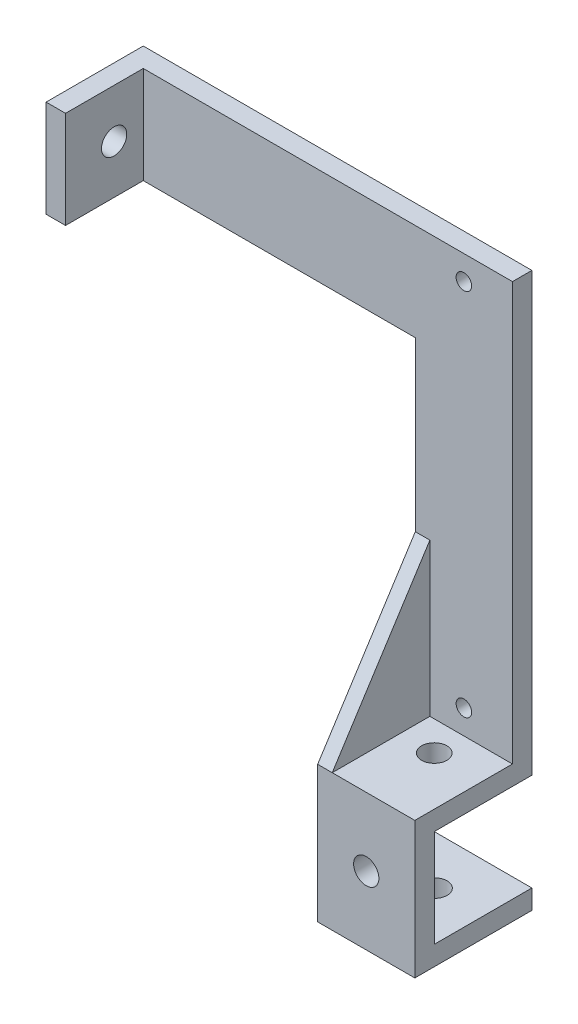
ISO-10303-21;
HEADER;
FILE_DESCRIPTION(('STEP AP214'),'2;1');
FILE_NAME('part.step','',(''),(''),'','','');
FILE_SCHEMA(('AUTOMOTIVE_DESIGN { 1 0 10303 214 1 1 1 1 }'));
ENDSEC;
DATA;
#1=APPLICATION_CONTEXT('core data for automotive mechanical design processes');
#2=APPLICATION_PROTOCOL_DEFINITION('international standard','automotive_design',2000,#1);
#3=PRODUCT_CONTEXT('',#1,'mechanical');
#4=PRODUCT('Part','Part','',(#3));
#5=PRODUCT_RELATED_PRODUCT_CATEGORY('part','',(#4));
#6=PRODUCT_DEFINITION_FORMATION('','',#4);
#7=PRODUCT_DEFINITION_CONTEXT('part definition',#1,'design');
#8=PRODUCT_DEFINITION('design','',#6,#7);
#9=PRODUCT_DEFINITION_SHAPE('','',#8);
#10=(LENGTH_UNIT() NAMED_UNIT(*) SI_UNIT(.MILLI.,.METRE.));
#11=(NAMED_UNIT(*) PLANE_ANGLE_UNIT() SI_UNIT($,.RADIAN.));
#12=(NAMED_UNIT(*) SI_UNIT($,.STERADIAN.) SOLID_ANGLE_UNIT());
#13=UNCERTAINTY_MEASURE_WITH_UNIT(LENGTH_MEASURE(1.E-05),#10,'distance_accuracy_value','');
#14=(GEOMETRIC_REPRESENTATION_CONTEXT(3) GLOBAL_UNCERTAINTY_ASSIGNED_CONTEXT((#13)) GLOBAL_UNIT_ASSIGNED_CONTEXT((#10,
#11,#12)) REPRESENTATION_CONTEXT('',''));
#15=CARTESIAN_POINT('',(0.,0.,0.));
#16=DIRECTION('',(0.,0.,1.));
#17=DIRECTION('',(1.,0.,0.));
#18=AXIS2_PLACEMENT_3D('',#15,#16,#17);
#19=CARTESIAN_POINT('',(0.,0.,4.));
#20=DIRECTION('',(0.,0.,-1.));
#21=DIRECTION('',(-1.,0.,0.));
#22=AXIS2_PLACEMENT_3D('',#19,#20,#21);
#23=PLANE('',#22);
#24=CARTESIAN_POINT('',(-19.2096770606013,-38.2608856625275,4.));
#25=DIRECTION('',(0.,0.,-1.));
#26=DIRECTION('',(-1.,0.,0.));
#27=AXIS2_PLACEMENT_3D('',#24,#25,#26);
#28=CIRCLE('',#27,1.6);
#29=CARTESIAN_POINT('',(-20.8096770606013,-38.2608856625275,4.));
#30=VERTEX_POINT('',#29);
#31=EDGE_CURVE('E241',#30,#30,#28,.T.);
#32=ORIENTED_EDGE('',*,*,#31,.T.);
#33=EDGE_LOOP('',(#32));
#34=FACE_BOUND('',#33,.T.);
#35=CARTESIAN_POINT('',(-19.2096770606013,37.7391143374725,4.));
#36=DIRECTION('',(0.,0.,-1.));
#37=DIRECTION('',(-1.,0.,0.));
#38=AXIS2_PLACEMENT_3D('',#35,#36,#37);
#39=CIRCLE('',#38,1.6);
#40=CARTESIAN_POINT('',(-20.8096770606013,37.7391143374725,4.));
#41=VERTEX_POINT('',#40);
#42=EDGE_CURVE('E248',#41,#41,#39,.T.);
#43=ORIENTED_EDGE('',*,*,#42,.T.);
#44=EDGE_LOOP('',(#43));
#45=FACE_BOUND('',#44,.T.);
#46=DIRECTION('',(0.,1.,0.));
#47=VECTOR('',#46,1.);
#48=CARTESIAN_POINT('',(-85.2096770606013,42.7391143374725,4.));
#49=LINE('',#48,#47);
#50=CARTESIAN_POINT('',(-85.2096770606013,22.7391143374725,4.));
#51=VERTEX_POINT('',#50);
#52=CARTESIAN_POINT('',(-85.2096770606013,42.7391143374725,4.));
#53=VERTEX_POINT('',#52);
#54=EDGE_CURVE('E182',#51,#53,#49,.T.);
#55=ORIENTED_EDGE('',*,*,#54,.F.);
#56=DIRECTION('',(1.,0.,0.));
#57=VECTOR('',#56,1.);
#58=CARTESIAN_POINT('',(-89.2096770606013,22.7391143374725,4.));
#59=LINE('',#58,#57);
#60=CARTESIAN_POINT('',(-29.2096770606013,22.7391143374725,4.));
#61=VERTEX_POINT('',#60);
#62=EDGE_CURVE('E166',#51,#61,#59,.T.);
#63=ORIENTED_EDGE('',*,*,#62,.T.);
#64=DIRECTION('',(0.,-1.,0.));
#65=VECTOR('',#64,1.);
#66=CARTESIAN_POINT('',(-29.2096770606013,42.7391143374725,4.));
#67=LINE('',#66,#65);
#68=CARTESIAN_POINT('',(-29.2096770606013,-11.8482809730409,4.));
#69=VERTEX_POINT('',#68);
#70=EDGE_CURVE('E340',#61,#69,#67,.T.);
#71=ORIENTED_EDGE('',*,*,#70,.T.);
#72=DIRECTION('',(-1.,0.,0.));
#73=VECTOR('',#72,1.);
#74=CARTESIAN_POINT('',(-26.2096770606013,-11.8482809730409,4.));
#75=LINE('',#74,#73);
#76=CARTESIAN_POINT('',(-26.2096770606013,-11.8482809730409,4.));
#77=VERTEX_POINT('',#76);
#78=EDGE_CURVE('E229',#77,#69,#75,.T.);
#79=ORIENTED_EDGE('',*,*,#78,.F.);
#80=DIRECTION('',(0.,-1.,0.));
#81=VECTOR('',#80,1.);
#82=CARTESIAN_POINT('',(-26.2096770606013,-43.2608856625275,4.));
#83=LINE('',#82,#81);
#84=CARTESIAN_POINT('',(-26.2096770606013,-43.2608856625275,4.));
#85=VERTEX_POINT('',#84);
#86=EDGE_CURVE('E213',#77,#85,#83,.T.);
#87=ORIENTED_EDGE('',*,*,#86,.T.);
#88=DIRECTION('',(-1.,0.,0.));
#89=VECTOR('',#88,1.);
#90=CARTESIAN_POINT('',(-29.2096770606013,-43.2608856625275,4.));
#91=LINE('',#90,#89);
#92=CARTESIAN_POINT('',(-9.20967706060125,-43.2608856625275,4.));
#93=VERTEX_POINT('',#92);
#94=EDGE_CURVE('E313',#93,#85,#91,.T.);
#95=ORIENTED_EDGE('',*,*,#94,.F.);
#96=DIRECTION('',(0.,1.,0.));
#97=VECTOR('',#96,1.);
#98=CARTESIAN_POINT('',(-9.20967706060126,42.7391143374725,4.));
#99=LINE('',#98,#97);
#100=CARTESIAN_POINT('',(-9.20967706060126,42.7391143374725,4.));
#101=VERTEX_POINT('',#100);
#102=EDGE_CURVE('E332',#93,#101,#99,.T.);
#103=ORIENTED_EDGE('',*,*,#102,.T.);
#104=DIRECTION('',(-1.,0.,0.));
#105=VECTOR('',#104,1.);
#106=CARTESIAN_POINT('',(-9.20967706060126,42.7391143374725,4.));
#107=LINE('',#106,#105);
#108=EDGE_CURVE('E335',#101,#53,#107,.T.);
#109=ORIENTED_EDGE('',*,*,#108,.T.);
#110=EDGE_LOOP('',(#55,#63,#71,#79,#87,#95,#103,#109));
#111=FACE_BOUND('',#110,.T.);
#112=ADVANCED_FACE('F39',(#34,#45,#111),#23,.F.);
#113=CARTESIAN_POINT('',(-29.2096770606013,42.7391143374725,4.));
#114=DIRECTION('',(1.,0.,0.));
#115=DIRECTION('',(0.,0.,-1.));
#116=AXIS2_PLACEMENT_3D('',#113,#114,#115);
#117=PLANE('',#116);
#118=DIRECTION('',(0.,0.,1.));
#119=VECTOR('',#118,1.);
#120=CARTESIAN_POINT('',(-29.2096770606013,22.7391143374725,0.));
#121=LINE('',#120,#119);
#122=CARTESIAN_POINT('',(-29.2096770606013,22.7391143374725,0.));
#123=VERTEX_POINT('',#122);
#124=EDGE_CURVE('E57',#123,#61,#121,.T.);
#125=ORIENTED_EDGE('',*,*,#124,.F.);
#126=DIRECTION('',(0.,-1.,0.));
#127=VECTOR('',#126,1.);
#128=CARTESIAN_POINT('',(-29.2096770606013,42.7391143374725,0.));
#129=LINE('',#128,#127);
#130=CARTESIAN_POINT('',(-29.2096770606013,-47.2608856625275,0.));
#131=VERTEX_POINT('',#130);
#132=EDGE_CURVE('E349',#123,#131,#129,.T.);
#133=ORIENTED_EDGE('',*,*,#132,.T.);
#134=DIRECTION('',(0.,0.,-1.));
#135=VECTOR('',#134,1.);
#136=CARTESIAN_POINT('',(-29.2096770606013,-47.2608856625275,4.));
#137=LINE('',#136,#135);
#138=CARTESIAN_POINT('',(-29.2096770606013,-47.2608856625275,20.1));
#139=VERTEX_POINT('',#138);
#140=EDGE_CURVE('E49',#139,#131,#137,.T.);
#141=ORIENTED_EDGE('',*,*,#140,.F.);
#142=DIRECTION('',(0.,1.,0.));
#143=VECTOR('',#142,1.);
#144=CARTESIAN_POINT('',(-29.2096770606013,-71.3608856625275,20.1));
#145=LINE('',#144,#143);
#146=CARTESIAN_POINT('',(-29.2096770606013,-67.3608856625275,20.1));
#147=VERTEX_POINT('',#146);
#148=EDGE_CURVE('E65',#147,#139,#145,.T.);
#149=ORIENTED_EDGE('',*,*,#148,.F.);
#150=DIRECTION('',(0.,0.,1.));
#151=VECTOR('',#150,1.);
#152=CARTESIAN_POINT('',(-29.2096770606013,-67.3608856625275,0.));
#153=LINE('',#152,#151);
#154=CARTESIAN_POINT('',(-29.2096770606013,-67.3608856625275,0.));
#155=VERTEX_POINT('',#154);
#156=EDGE_CURVE('E291',#155,#147,#153,.T.);
#157=ORIENTED_EDGE('',*,*,#156,.F.);
#158=DIRECTION('',(0.,1.,0.));
#159=VECTOR('',#158,1.);
#160=CARTESIAN_POINT('',(-29.2096770606013,-71.3608856625275,0.));
#161=LINE('',#160,#159);
#162=CARTESIAN_POINT('',(-29.2096770606013,-71.3608856625275,0.));
#163=VERTEX_POINT('',#162);
#164=EDGE_CURVE('E279',#163,#155,#161,.T.);
#165=ORIENTED_EDGE('',*,*,#164,.F.);
#166=DIRECTION('',(0.,0.,-1.));
#167=VECTOR('',#166,1.);
#168=CARTESIAN_POINT('',(-29.2096770606013,-71.3608856625275,24.1));
#169=LINE('',#168,#167);
#170=CARTESIAN_POINT('',(-29.2096770606013,-71.3608856625275,24.1));
#171=VERTEX_POINT('',#170);
#172=EDGE_CURVE('E303',#171,#163,#169,.T.);
#173=ORIENTED_EDGE('',*,*,#172,.F.);
#174=DIRECTION('',(0.,-1.,0.));
#175=VECTOR('',#174,1.);
#176=CARTESIAN_POINT('',(-29.2096770606013,-43.2608856625275,24.1));
#177=LINE('',#176,#175);
#178=CARTESIAN_POINT('',(-29.2096770606013,-43.2608856625275,24.1));
#179=VERTEX_POINT('',#178);
#180=EDGE_CURVE('E314',#179,#171,#177,.T.);
#181=ORIENTED_EDGE('',*,*,#180,.F.);
#182=DIRECTION('',(0.,0.842320911565754,-0.538976327809522));
#183=VECTOR('',#182,1.);
#184=CARTESIAN_POINT('',(-29.2096770606013,-11.8482809730409,4.));
#185=LINE('',#184,#183);
#186=EDGE_CURVE('E212',#179,#69,#185,.T.);
#187=ORIENTED_EDGE('',*,*,#186,.T.);
#188=ORIENTED_EDGE('',*,*,#70,.F.);
#189=EDGE_LOOP('',(#125,#133,#141,#149,#157,#165,#173,#181,#187,#188));
#190=FACE_BOUND('',#189,.T.);
#191=ADVANCED_FACE('F381',(#190),#117,.F.);
#192=CARTESIAN_POINT('',(-29.2096770606013,-43.2608856625275,24.1));
#193=DIRECTION('',(0.,-1.,0.));
#194=DIRECTION('',(1.,0.,0.));
#195=AXIS2_PLACEMENT_3D('',#192,#193,#194);
#196=PLANE('',#195);
#197=CARTESIAN_POINT('',(-19.2096770606013,-43.2608856625275,10.094759339097));
#198=DIRECTION('',(0.,-1.,0.));
#199=DIRECTION('',(1.,0.,0.));
#200=AXIS2_PLACEMENT_3D('',#197,#198,#199);
#201=CIRCLE('',#200,2.6);
#202=CARTESIAN_POINT('',(-16.6096770606013,-43.2608856625275,10.094759339097));
#203=VERTEX_POINT('',#202);
#204=EDGE_CURVE('E269',#203,#203,#201,.T.);
#205=ORIENTED_EDGE('',*,*,#204,.T.);
#206=EDGE_LOOP('',(#205));
#207=FACE_BOUND('',#206,.T.);
#208=DIRECTION('',(0.,0.,1.));
#209=VECTOR('',#208,1.);
#210=CARTESIAN_POINT('',(-26.2096770606013,-43.2608856625275,24.1));
#211=LINE('',#210,#209);
#212=CARTESIAN_POINT('',(-26.2096770606013,-43.2608856625275,24.1));
#213=VERTEX_POINT('',#212);
#214=EDGE_CURVE('E217',#85,#213,#211,.T.);
#215=ORIENTED_EDGE('',*,*,#214,.T.);
#216=DIRECTION('',(-1.,0.,0.));
#217=VECTOR('',#216,1.);
#218=CARTESIAN_POINT('',(-29.2096770606013,-43.2608856625275,24.1));
#219=LINE('',#218,#217);
#220=CARTESIAN_POINT('',(-9.20967706060125,-43.2608856625275,24.1));
#221=VERTEX_POINT('',#220);
#222=EDGE_CURVE('E320',#221,#213,#219,.T.);
#223=ORIENTED_EDGE('',*,*,#222,.F.);
#224=DIRECTION('',(0.,0.,-1.));
#225=VECTOR('',#224,1.);
#226=CARTESIAN_POINT('',(-9.20967706060125,-43.2608856625275,24.1));
#227=LINE('',#226,#225);
#228=EDGE_CURVE('E324',#221,#93,#227,.T.);
#229=ORIENTED_EDGE('',*,*,#228,.T.);
#230=ORIENTED_EDGE('',*,*,#94,.T.);
#231=EDGE_LOOP('',(#215,#223,#229,#230));
#232=FACE_BOUND('',#231,.T.);
#233=ADVANCED_FACE('F394',(#207,#232),#196,.F.);
#234=CARTESIAN_POINT('',(-9.20967706060124,-71.3608856625275,20.1));
#235=DIRECTION('',(0.,0.,1.));
#236=DIRECTION('',(1.,0.,0.));
#237=AXIS2_PLACEMENT_3D('',#234,#235,#236);
#238=PLANE('',#237);
#239=CARTESIAN_POINT('',(-19.2096770606013,-57.3108856625275,20.1));
#240=DIRECTION('',(0.,0.,-1.));
#241=DIRECTION('',(-1.,0.,0.));
#242=AXIS2_PLACEMENT_3D('',#239,#240,#241);
#243=CIRCLE('',#242,2.6);
#244=CARTESIAN_POINT('',(-21.8096770606012,-57.3108856625275,20.1));
#245=VERTEX_POINT('',#244);
#246=EDGE_CURVE('E260',#245,#245,#243,.T.);
#247=ORIENTED_EDGE('',*,*,#246,.F.);
#248=EDGE_LOOP('',(#247));
#249=FACE_BOUND('',#248,.T.);
#250=DIRECTION('',(1.,0.,0.));
#251=VECTOR('',#250,1.);
#252=CARTESIAN_POINT('',(-9.20967706060124,-67.3608856625275,20.1));
#253=LINE('',#252,#251);
#254=CARTESIAN_POINT('',(-9.20967706060124,-67.3608856625275,20.1));
#255=VERTEX_POINT('',#254);
#256=EDGE_CURVE('E275',#147,#255,#253,.T.);
#257=ORIENTED_EDGE('',*,*,#256,.F.);
#258=ORIENTED_EDGE('',*,*,#148,.T.);
#259=DIRECTION('',(1.,0.,0.));
#260=VECTOR('',#259,1.);
#261=CARTESIAN_POINT('',(-9.20967706060125,-47.2608856625275,20.1));
#262=LINE('',#261,#260);
#263=CARTESIAN_POINT('',(-9.20967706060125,-47.2608856625275,20.1));
#264=VERTEX_POINT('',#263);
#265=EDGE_CURVE('E294',#139,#264,#262,.T.);
#266=ORIENTED_EDGE('',*,*,#265,.T.);
#267=DIRECTION('',(0.,1.,0.));
#268=VECTOR('',#267,1.);
#269=CARTESIAN_POINT('',(-9.20967706060124,-71.3608856625275,20.1));
#270=LINE('',#269,#268);
#271=EDGE_CURVE('E306',#255,#264,#270,.T.);
#272=ORIENTED_EDGE('',*,*,#271,.F.);
#273=EDGE_LOOP('',(#257,#258,#266,#272));
#274=FACE_BOUND('',#273,.T.);
#275=ADVANCED_FACE('F415',(#249,#274),#238,.F.);
#276=CARTESIAN_POINT('',(-9.20967706060125,-47.2608856625275,4.));
#277=DIRECTION('',(0.,1.,0.));
#278=DIRECTION('',(-1.,0.,0.));
#279=AXIS2_PLACEMENT_3D('',#276,#277,#278);
#280=PLANE('',#279);
#281=CARTESIAN_POINT('',(-19.2096770606013,-47.2608856625275,10.094759339097));
#282=DIRECTION('',(0.,-1.,0.));
#283=DIRECTION('',(1.,0.,0.));
#284=AXIS2_PLACEMENT_3D('',#281,#282,#283);
#285=CIRCLE('',#284,2.6);
#286=CARTESIAN_POINT('',(-16.6096770606013,-47.2608856625275,10.094759339097));
#287=VERTEX_POINT('',#286);
#288=EDGE_CURVE('E265',#287,#287,#285,.T.);
#289=ORIENTED_EDGE('',*,*,#288,.F.);
#290=EDGE_LOOP('',(#289));
#291=FACE_BOUND('',#290,.T.);
#292=ORIENTED_EDGE('',*,*,#265,.F.);
#293=ORIENTED_EDGE('',*,*,#140,.T.);
#294=DIRECTION('',(1.,0.,0.));
#295=VECTOR('',#294,1.);
#296=CARTESIAN_POINT('',(-9.20967706060125,-47.2608856625275,0.));
#297=LINE('',#296,#295);
#298=CARTESIAN_POINT('',(-9.20967706060125,-47.2608856625275,0.));
#299=VERTEX_POINT('',#298);
#300=EDGE_CURVE('E336',#131,#299,#297,.T.);
#301=ORIENTED_EDGE('',*,*,#300,.T.);
#302=DIRECTION('',(0.,0.,-1.));
#303=VECTOR('',#302,1.);
#304=CARTESIAN_POINT('',(-9.20967706060125,-47.2608856625275,4.));
#305=LINE('',#304,#303);
#306=EDGE_CURVE('E343',#264,#299,#305,.T.);
#307=ORIENTED_EDGE('',*,*,#306,.F.);
#308=EDGE_LOOP('',(#292,#293,#301,#307));
#309=FACE_BOUND('',#308,.T.);
#310=ADVANCED_FACE('F413',(#291,#309),#280,.F.);
#311=CARTESIAN_POINT('',(-9.20967706060126,42.7391143374725,4.));
#312=DIRECTION('',(-1.,0.,0.));
#313=DIRECTION('',(0.,-1.,0.));
#314=AXIS2_PLACEMENT_3D('',#311,#312,#313);
#315=PLANE('',#314);
#316=DIRECTION('',(0.,1.,0.));
#317=VECTOR('',#316,1.);
#318=CARTESIAN_POINT('',(-9.20967706060126,42.7391143374725,0.));
#319=LINE('',#318,#317);
#320=CARTESIAN_POINT('',(-9.20967706060126,42.7391143374725,0.));
#321=VERTEX_POINT('',#320);
#322=EDGE_CURVE('E331',#299,#321,#319,.T.);
#323=ORIENTED_EDGE('',*,*,#322,.T.);
#324=DIRECTION('',(0.,0.,-1.));
#325=VECTOR('',#324,1.);
#326=CARTESIAN_POINT('',(-9.20967706060126,42.7391143374725,4.));
#327=LINE('',#326,#325);
#328=EDGE_CURVE('E11',#101,#321,#327,.T.);
#329=ORIENTED_EDGE('',*,*,#328,.F.);
#330=ORIENTED_EDGE('',*,*,#102,.F.);
#331=ORIENTED_EDGE('',*,*,#228,.F.);
#332=DIRECTION('',(0.,1.,0.));
#333=VECTOR('',#332,1.);
#334=CARTESIAN_POINT('',(-9.20967706060125,-47.2608856625275,24.1));
#335=LINE('',#334,#333);
#336=CARTESIAN_POINT('',(-9.20967706060124,-71.3608856625275,24.1));
#337=VERTEX_POINT('',#336);
#338=EDGE_CURVE('E317',#337,#221,#335,.T.);
#339=ORIENTED_EDGE('',*,*,#338,.F.);
#340=DIRECTION('',(0.,0.,1.));
#341=VECTOR('',#340,1.);
#342=CARTESIAN_POINT('',(-9.20967706060124,-71.3608856625275,20.1));
#343=LINE('',#342,#341);
#344=CARTESIAN_POINT('',(-9.20967706060124,-71.3608856625275,0.));
#345=VERTEX_POINT('',#344);
#346=EDGE_CURVE('E295',#345,#337,#343,.T.);
#347=ORIENTED_EDGE('',*,*,#346,.F.);
#348=DIRECTION('',(0.,-1.,0.));
#349=VECTOR('',#348,1.);
#350=CARTESIAN_POINT('',(-9.20967706060124,-67.3608856625275,0.));
#351=LINE('',#350,#349);
#352=CARTESIAN_POINT('',(-9.20967706060124,-67.3608856625275,0.));
#353=VERTEX_POINT('',#352);
#354=EDGE_CURVE('E270',#353,#345,#351,.T.);
#355=ORIENTED_EDGE('',*,*,#354,.F.);
#356=DIRECTION('',(0.,0.,1.));
#357=VECTOR('',#356,1.);
#358=CARTESIAN_POINT('',(-9.20967706060124,-67.3608856625275,0.));
#359=LINE('',#358,#357);
#360=EDGE_CURVE('E285',#353,#255,#359,.T.);
#361=ORIENTED_EDGE('',*,*,#360,.T.);
#362=ORIENTED_EDGE('',*,*,#271,.T.);
#363=ORIENTED_EDGE('',*,*,#306,.T.);
#364=EDGE_LOOP('',(#323,#329,#330,#331,#339,#347,#355,#361,#362,#363));
#365=FACE_BOUND('',#364,.T.);
#366=ADVANCED_FACE('F41',(#365),#315,.F.);
#367=CARTESIAN_POINT('',(-9.20967706060126,42.7391143374725,4.));
#368=DIRECTION('',(0.,-1.,0.));
#369=DIRECTION('',(0.,0.,-1.));
#370=AXIS2_PLACEMENT_3D('',#367,#368,#369);
#371=PLANE('',#370);
#372=DIRECTION('',(-1.,0.,0.));
#373=VECTOR('',#372,1.);
#374=CARTESIAN_POINT('',(-9.20967706060126,42.7391143374725,0.));
#375=LINE('',#374,#373);
#376=CARTESIAN_POINT('',(-89.2096770606013,42.7391143374725,0.));
#377=VERTEX_POINT('',#376);
#378=EDGE_CURVE('E161',#321,#377,#375,.T.);
#379=ORIENTED_EDGE('',*,*,#378,.T.);
#380=DIRECTION('',(0.,0.,-1.));
#381=VECTOR('',#380,1.);
#382=CARTESIAN_POINT('',(-89.2096770606013,42.7391143374725,4.));
#383=LINE('',#382,#381);
#384=CARTESIAN_POINT('',(-89.2096770606013,42.7391143374725,20.));
#385=VERTEX_POINT('',#384);
#386=EDGE_CURVE('E155',#385,#377,#383,.T.);
#387=ORIENTED_EDGE('',*,*,#386,.F.);
#388=DIRECTION('',(-1.,0.,0.));
#389=VECTOR('',#388,1.);
#390=CARTESIAN_POINT('',(-85.2096770606013,42.7391143374725,20.));
#391=LINE('',#390,#389);
#392=CARTESIAN_POINT('',(-85.2096770606013,42.7391143374725,20.));
#393=VERTEX_POINT('',#392);
#394=EDGE_CURVE('E160',#393,#385,#391,.T.);
#395=ORIENTED_EDGE('',*,*,#394,.F.);
#396=DIRECTION('',(0.,0.,-1.));
#397=VECTOR('',#396,1.);
#398=CARTESIAN_POINT('',(-85.2096770606013,42.7391143374725,20.));
#399=LINE('',#398,#397);
#400=EDGE_CURVE('E192',#393,#53,#399,.T.);
#401=ORIENTED_EDGE('',*,*,#400,.T.);
#402=ORIENTED_EDGE('',*,*,#108,.F.);
#403=ORIENTED_EDGE('',*,*,#328,.T.);
#404=EDGE_LOOP('',(#379,#387,#395,#401,#402,#403));
#405=FACE_BOUND('',#404,.T.);
#406=ADVANCED_FACE('F157',(#405),#371,.F.);
#407=CARTESIAN_POINT('',(0.,0.,0.));
#408=DIRECTION('',(0.,0.,-1.));
#409=DIRECTION('',(-1.,0.,0.));
#410=AXIS2_PLACEMENT_3D('',#407,#408,#409);
#411=PLANE('',#410);
#412=CARTESIAN_POINT('',(-19.2096770606013,37.7391143374725,0.));
#413=DIRECTION('',(0.,0.,-1.));
#414=DIRECTION('',(-1.,0.,0.));
#415=AXIS2_PLACEMENT_3D('',#412,#413,#414);
#416=CIRCLE('',#415,1.6);
#417=CARTESIAN_POINT('',(-20.8096770606013,37.7391143374725,0.));
#418=VERTEX_POINT('',#417);
#419=EDGE_CURVE('E237',#418,#418,#416,.T.);
#420=ORIENTED_EDGE('',*,*,#419,.F.);
#421=EDGE_LOOP('',(#420));
#422=FACE_BOUND('',#421,.T.);
#423=CARTESIAN_POINT('',(-19.2096770606013,-38.2608856625275,0.));
#424=DIRECTION('',(0.,0.,-1.));
#425=DIRECTION('',(-1.,0.,0.));
#426=AXIS2_PLACEMENT_3D('',#423,#424,#425);
#427=CIRCLE('',#426,1.6);
#428=CARTESIAN_POINT('',(-20.8096770606013,-38.2608856625275,0.));
#429=VERTEX_POINT('',#428);
#430=EDGE_CURVE('E233',#429,#429,#427,.T.);
#431=ORIENTED_EDGE('',*,*,#430,.F.);
#432=EDGE_LOOP('',(#431));
#433=FACE_BOUND('',#432,.T.);
#434=ORIENTED_EDGE('',*,*,#322,.F.);
#435=ORIENTED_EDGE('',*,*,#300,.F.);
#436=ORIENTED_EDGE('',*,*,#132,.F.);
#437=DIRECTION('',(1.,0.,0.));
#438=VECTOR('',#437,1.);
#439=CARTESIAN_POINT('',(-89.2096770606013,22.7391143374725,0.));
#440=LINE('',#439,#438);
#441=CARTESIAN_POINT('',(-89.2096770606013,22.7391143374725,0.));
#442=VERTEX_POINT('',#441);
#443=EDGE_CURVE('E208',#442,#123,#440,.T.);
#444=ORIENTED_EDGE('',*,*,#443,.F.);
#445=DIRECTION('',(0.,-1.,0.));
#446=VECTOR('',#445,1.);
#447=CARTESIAN_POINT('',(-89.2096770606013,42.7391143374725,0.));
#448=LINE('',#447,#446);
#449=EDGE_CURVE('E199',#377,#442,#448,.T.);
#450=ORIENTED_EDGE('',*,*,#449,.F.);
#451=ORIENTED_EDGE('',*,*,#378,.F.);
#452=EDGE_LOOP('',(#434,#435,#436,#444,#450,#451));
#453=FACE_BOUND('',#452,.T.);
#454=ADVANCED_FACE('F373',(#422,#433,#453),#411,.T.);
#455=CARTESIAN_POINT('',(0.,0.,24.1));
#456=DIRECTION('',(0.,0.,1.));
#457=DIRECTION('',(1.,0.,0.));
#458=AXIS2_PLACEMENT_3D('',#455,#456,#457);
#459=PLANE('',#458);
#460=CARTESIAN_POINT('',(-19.2096770606013,-57.3108856625275,24.1));
#461=DIRECTION('',(0.,0.,1.));
#462=DIRECTION('',(1.,0.,0.));
#463=AXIS2_PLACEMENT_3D('',#460,#461,#462);
#464=CIRCLE('',#463,2.6);
#465=CARTESIAN_POINT('',(-16.6096770606013,-57.3108856625275,24.1));
#466=VERTEX_POINT('',#465);
#467=EDGE_CURVE('E264',#466,#466,#464,.T.);
#468=ORIENTED_EDGE('',*,*,#467,.F.);
#469=EDGE_LOOP('',(#468));
#470=FACE_BOUND('',#469,.T.);
#471=ORIENTED_EDGE('',*,*,#180,.T.);
#472=DIRECTION('',(-1.,0.,0.));
#473=VECTOR('',#472,1.);
#474=CARTESIAN_POINT('',(-9.20967706060124,-71.3608856625275,24.1));
#475=LINE('',#474,#473);
#476=EDGE_CURVE('E299',#337,#171,#475,.T.);
#477=ORIENTED_EDGE('',*,*,#476,.F.);
#478=ORIENTED_EDGE('',*,*,#338,.T.);
#479=ORIENTED_EDGE('',*,*,#222,.T.);
#480=DIRECTION('',(-1.,0.,0.));
#481=VECTOR('',#480,1.);
#482=CARTESIAN_POINT('',(-26.2096770606013,-43.2608856625275,24.1));
#483=LINE('',#482,#481);
#484=EDGE_CURVE('E225',#213,#179,#483,.T.);
#485=ORIENTED_EDGE('',*,*,#484,.T.);
#486=EDGE_LOOP('',(#471,#477,#478,#479,#485));
#487=FACE_BOUND('',#486,.T.);
#488=ADVANCED_FACE('F369',(#470,#487),#459,.T.);
#489=CARTESIAN_POINT('',(0.,-71.3608856625275,0.));
#490=DIRECTION('',(0.,-1.,0.));
#491=DIRECTION('',(1.,0.,0.));
#492=AXIS2_PLACEMENT_3D('',#489,#490,#491);
#493=PLANE('',#492);
#494=CARTESIAN_POINT('',(-19.2096770606012,-71.3608856625275,10.05));
#495=DIRECTION('',(0.,-1.,0.));
#496=DIRECTION('',(1.,0.,0.));
#497=AXIS2_PLACEMENT_3D('',#494,#495,#496);
#498=CIRCLE('',#497,2.6);
#499=CARTESIAN_POINT('',(-16.6096770606012,-71.3608856625275,10.05));
#500=VERTEX_POINT('',#499);
#501=EDGE_CURVE('E256',#500,#500,#498,.T.);
#502=ORIENTED_EDGE('',*,*,#501,.F.);
#503=EDGE_LOOP('',(#502));
#504=FACE_BOUND('',#503,.T.);
#505=ORIENTED_EDGE('',*,*,#346,.T.);
#506=ORIENTED_EDGE('',*,*,#476,.T.);
#507=ORIENTED_EDGE('',*,*,#172,.T.);
#508=DIRECTION('',(-1.,0.,0.));
#509=VECTOR('',#508,1.);
#510=CARTESIAN_POINT('',(-9.20967706060124,-71.3608856625275,0.));
#511=LINE('',#510,#509);
#512=EDGE_CURVE('E274',#345,#163,#511,.T.);
#513=ORIENTED_EDGE('',*,*,#512,.F.);
#514=EDGE_LOOP('',(#505,#506,#507,#513));
#515=FACE_BOUND('',#514,.T.);
#516=ADVANCED_FACE('F372',(#504,#515),#493,.T.);
#517=CARTESIAN_POINT('',(-9.20967706060124,-67.3608856625275,0.));
#518=DIRECTION('',(0.,-1.,0.));
#519=DIRECTION('',(0.,0.,-1.));
#520=AXIS2_PLACEMENT_3D('',#517,#518,#519);
#521=PLANE('',#520);
#522=CARTESIAN_POINT('',(-19.2096770606012,-67.3608856625275,10.05));
#523=DIRECTION('',(0.,1.,0.));
#524=DIRECTION('',(0.,0.,1.));
#525=AXIS2_PLACEMENT_3D('',#522,#523,#524);
#526=CIRCLE('',#525,2.6);
#527=CARTESIAN_POINT('',(-19.2096770606012,-67.3608856625275,12.65));
#528=VERTEX_POINT('',#527);
#529=EDGE_CURVE('E252',#528,#528,#526,.T.);
#530=ORIENTED_EDGE('',*,*,#529,.F.);
#531=EDGE_LOOP('',(#530));
#532=FACE_BOUND('',#531,.T.);
#533=ORIENTED_EDGE('',*,*,#256,.T.);
#534=ORIENTED_EDGE('',*,*,#360,.F.);
#535=DIRECTION('',(1.,0.,0.));
#536=VECTOR('',#535,1.);
#537=CARTESIAN_POINT('',(-9.20967706060124,-67.3608856625275,0.));
#538=LINE('',#537,#536);
#539=EDGE_CURVE('E282',#155,#353,#538,.T.);
#540=ORIENTED_EDGE('',*,*,#539,.F.);
#541=ORIENTED_EDGE('',*,*,#156,.T.);
#542=EDGE_LOOP('',(#533,#534,#540,#541));
#543=FACE_BOUND('',#542,.T.);
#544=ADVANCED_FACE('F470',(#532,#543),#521,.F.);
#545=CARTESIAN_POINT('',(0.,0.,0.));
#546=DIRECTION('',(0.,0.,-1.));
#547=DIRECTION('',(-1.,0.,0.));
#548=AXIS2_PLACEMENT_3D('',#545,#546,#547);
#549=PLANE('',#548);
#550=ORIENTED_EDGE('',*,*,#354,.T.);
#551=ORIENTED_EDGE('',*,*,#512,.T.);
#552=ORIENTED_EDGE('',*,*,#164,.T.);
#553=ORIENTED_EDGE('',*,*,#539,.T.);
#554=EDGE_LOOP('',(#550,#551,#552,#553));
#555=FACE_BOUND('',#554,.T.);
#556=ADVANCED_FACE('F385',(#555),#549,.T.);
#557=CARTESIAN_POINT('',(-19.2096770606013,-27.2608856625275,10.094759339097));
#558=DIRECTION('',(0.,-1.,0.));
#559=DIRECTION('',(1.,0.,0.));
#560=AXIS2_PLACEMENT_3D('',#557,#558,#559);
#561=CYLINDRICAL_SURFACE('',#560,2.6);
#562=ORIENTED_EDGE('',*,*,#288,.T.);
#563=EDGE_LOOP('',(#562));
#564=FACE_BOUND('',#563,.T.);
#565=ORIENTED_EDGE('',*,*,#204,.F.);
#566=EDGE_LOOP('',(#565));
#567=FACE_BOUND('',#566,.T.);
#568=ADVANCED_FACE('F486',(#564,#567),#561,.F.);
#569=CARTESIAN_POINT('',(-19.2096770606013,-57.3108856625275,40.1));
#570=DIRECTION('',(0.,0.,-1.));
#571=DIRECTION('',(-1.,0.,0.));
#572=AXIS2_PLACEMENT_3D('',#569,#570,#571);
#573=CYLINDRICAL_SURFACE('',#572,2.6);
#574=ORIENTED_EDGE('',*,*,#467,.T.);
#575=EDGE_LOOP('',(#574));
#576=FACE_BOUND('',#575,.T.);
#577=ORIENTED_EDGE('',*,*,#246,.T.);
#578=EDGE_LOOP('',(#577));
#579=FACE_BOUND('',#578,.T.);
#580=ADVANCED_FACE('F366',(#576,#579),#573,.F.);
#581=CARTESIAN_POINT('',(-19.2096770606012,-87.3608856625275,10.05));
#582=DIRECTION('',(0.,1.,0.));
#583=DIRECTION('',(0.,0.,1.));
#584=AXIS2_PLACEMENT_3D('',#581,#582,#583);
#585=CYLINDRICAL_SURFACE('',#584,2.6);
#586=ORIENTED_EDGE('',*,*,#501,.T.);
#587=EDGE_LOOP('',(#586));
#588=FACE_BOUND('',#587,.T.);
#589=ORIENTED_EDGE('',*,*,#529,.T.);
#590=EDGE_LOOP('',(#589));
#591=FACE_BOUND('',#590,.T.);
#592=ADVANCED_FACE('F500',(#588,#591),#585,.F.);
#593=CARTESIAN_POINT('',(-19.2096770606013,-38.2608856625275,20.));
#594=DIRECTION('',(0.,0.,-1.));
#595=DIRECTION('',(-1.,0.,0.));
#596=AXIS2_PLACEMENT_3D('',#593,#594,#595);
#597=CYLINDRICAL_SURFACE('',#596,1.6);
#598=ORIENTED_EDGE('',*,*,#430,.T.);
#599=EDGE_LOOP('',(#598));
#600=FACE_BOUND('',#599,.T.);
#601=ORIENTED_EDGE('',*,*,#31,.F.);
#602=EDGE_LOOP('',(#601));
#603=FACE_BOUND('',#602,.T.);
#604=ADVANCED_FACE('F506',(#600,#603),#597,.F.);
#605=CARTESIAN_POINT('',(-19.2096770606013,37.7391143374725,20.));
#606=DIRECTION('',(0.,0.,-1.));
#607=DIRECTION('',(-1.,0.,0.));
#608=AXIS2_PLACEMENT_3D('',#605,#606,#607);
#609=CYLINDRICAL_SURFACE('',#608,1.6);
#610=ORIENTED_EDGE('',*,*,#419,.T.);
#611=EDGE_LOOP('',(#610));
#612=FACE_BOUND('',#611,.T.);
#613=ORIENTED_EDGE('',*,*,#42,.F.);
#614=EDGE_LOOP('',(#613));
#615=FACE_BOUND('',#614,.T.);
#616=ADVANCED_FACE('F514',(#612,#615),#609,.F.);
#617=CARTESIAN_POINT('',(-26.2096770606013,-11.8482809730409,4.));
#618=DIRECTION('',(0.,0.538976327809522,0.842320911565754));
#619=DIRECTION('',(0.,-0.842320911565754,0.538976327809522));
#620=AXIS2_PLACEMENT_3D('',#617,#618,#619);
#621=PLANE('',#620);
#622=ORIENTED_EDGE('',*,*,#186,.F.);
#623=ORIENTED_EDGE('',*,*,#484,.F.);
#624=DIRECTION('',(0.,0.842320911565754,-0.538976327809522));
#625=VECTOR('',#624,1.);
#626=CARTESIAN_POINT('',(-26.2096770606013,-11.8482809730409,4.));
#627=LINE('',#626,#625);
#628=EDGE_CURVE('E221',#213,#77,#627,.T.);
#629=ORIENTED_EDGE('',*,*,#628,.T.);
#630=ORIENTED_EDGE('',*,*,#78,.T.);
#631=EDGE_LOOP('',(#622,#623,#629,#630));
#632=FACE_BOUND('',#631,.T.);
#633=ADVANCED_FACE('F402',(#632),#621,.T.);
#634=CARTESIAN_POINT('',(-26.2096770606013,0.,0.));
#635=DIRECTION('',(-1.,0.,0.));
#636=DIRECTION('',(0.,0.,1.));
#637=AXIS2_PLACEMENT_3D('',#634,#635,#636);
#638=PLANE('',#637);
#639=ORIENTED_EDGE('',*,*,#86,.F.);
#640=ORIENTED_EDGE('',*,*,#628,.F.);
#641=ORIENTED_EDGE('',*,*,#214,.F.);
#642=EDGE_LOOP('',(#639,#640,#641));
#643=FACE_BOUND('',#642,.T.);
#644=ADVANCED_FACE('F397',(#643),#638,.F.);
#645=CARTESIAN_POINT('',(-89.2096770606013,22.7391143374725,0.));
#646=DIRECTION('',(0.,1.,0.));
#647=DIRECTION('',(0.,0.,1.));
#648=AXIS2_PLACEMENT_3D('',#645,#646,#647);
#649=PLANE('',#648);
#650=ORIENTED_EDGE('',*,*,#124,.T.);
#651=ORIENTED_EDGE('',*,*,#62,.F.);
#652=DIRECTION('',(0.,0.,-1.));
#653=VECTOR('',#652,1.);
#654=CARTESIAN_POINT('',(-85.2096770606013,22.7391143374725,20.));
#655=LINE('',#654,#653);
#656=CARTESIAN_POINT('',(-85.2096770606013,22.7391143374725,20.));
#657=VERTEX_POINT('',#656);
#658=EDGE_CURVE('E196',#657,#51,#655,.T.);
#659=ORIENTED_EDGE('',*,*,#658,.F.);
#660=DIRECTION('',(1.,0.,0.));
#661=VECTOR('',#660,1.);
#662=CARTESIAN_POINT('',(-89.2096770606013,22.7391143374725,20.));
#663=LINE('',#662,#661);
#664=CARTESIAN_POINT('',(-89.2096770606013,22.7391143374725,20.));
#665=VERTEX_POINT('',#664);
#666=EDGE_CURVE('E175',#665,#657,#663,.T.);
#667=ORIENTED_EDGE('',*,*,#666,.F.);
#668=DIRECTION('',(0.,0.,1.));
#669=VECTOR('',#668,1.);
#670=CARTESIAN_POINT('',(-89.2096770606013,22.7391143374725,0.));
#671=LINE('',#670,#669);
#672=EDGE_CURVE('E167',#442,#665,#671,.T.);
#673=ORIENTED_EDGE('',*,*,#672,.F.);
#674=ORIENTED_EDGE('',*,*,#443,.T.);
#675=EDGE_LOOP('',(#650,#651,#659,#667,#673,#674));
#676=FACE_BOUND('',#675,.T.);
#677=ADVANCED_FACE('F405',(#676),#649,.F.);
#678=CARTESIAN_POINT('',(-89.2096770606013,0.,0.));
#679=DIRECTION('',(-1.,0.,0.));
#680=DIRECTION('',(0.,0.,1.));
#681=AXIS2_PLACEMENT_3D('',#678,#679,#680);
#682=PLANE('',#681);
#683=CARTESIAN_POINT('',(-89.2096770606013,32.7391143374725,10.));
#684=DIRECTION('',(-1.,0.,0.));
#685=DIRECTION('',(0.,0.,1.));
#686=AXIS2_PLACEMENT_3D('',#683,#684,#685);
#687=CIRCLE('',#686,2.6);
#688=CARTESIAN_POINT('',(-89.2096770606013,32.7391143374725,12.6));
#689=VERTEX_POINT('',#688);
#690=EDGE_CURVE('E187',#689,#689,#687,.T.);
#691=ORIENTED_EDGE('',*,*,#690,.F.);
#692=EDGE_LOOP('',(#691));
#693=FACE_BOUND('',#692,.T.);
#694=ORIENTED_EDGE('',*,*,#449,.T.);
#695=ORIENTED_EDGE('',*,*,#672,.T.);
#696=DIRECTION('',(0.,-1.,0.));
#697=VECTOR('',#696,1.);
#698=CARTESIAN_POINT('',(-89.2096770606013,42.7391143374725,20.));
#699=LINE('',#698,#697);
#700=EDGE_CURVE('E170',#385,#665,#699,.T.);
#701=ORIENTED_EDGE('',*,*,#700,.F.);
#702=ORIENTED_EDGE('',*,*,#386,.T.);
#703=EDGE_LOOP('',(#694,#695,#701,#702));
#704=FACE_BOUND('',#703,.T.);
#705=ADVANCED_FACE('F171',(#693,#704),#682,.T.);
#706=CARTESIAN_POINT('',(-85.2096770606013,42.7391143374725,20.));
#707=DIRECTION('',(-1.,0.,0.));
#708=DIRECTION('',(0.,0.,1.));
#709=AXIS2_PLACEMENT_3D('',#706,#707,#708);
#710=PLANE('',#709);
#711=CARTESIAN_POINT('',(-85.2096770606013,32.7391143374725,10.));
#712=DIRECTION('',(-1.,0.,0.));
#713=DIRECTION('',(0.,0.,1.));
#714=AXIS2_PLACEMENT_3D('',#711,#712,#713);
#715=CIRCLE('',#714,2.6);
#716=CARTESIAN_POINT('',(-85.2096770606013,32.7391143374725,12.6));
#717=VERTEX_POINT('',#716);
#718=EDGE_CURVE('E43',#717,#717,#715,.T.);
#719=ORIENTED_EDGE('',*,*,#718,.T.);
#720=EDGE_LOOP('',(#719));
#721=FACE_BOUND('',#720,.T.);
#722=ORIENTED_EDGE('',*,*,#54,.T.);
#723=ORIENTED_EDGE('',*,*,#400,.F.);
#724=DIRECTION('',(0.,1.,0.));
#725=VECTOR('',#724,1.);
#726=CARTESIAN_POINT('',(-85.2096770606013,42.7391143374725,20.));
#727=LINE('',#726,#725);
#728=EDGE_CURVE('E179',#657,#393,#727,.T.);
#729=ORIENTED_EDGE('',*,*,#728,.F.);
#730=ORIENTED_EDGE('',*,*,#658,.T.);
#731=EDGE_LOOP('',(#722,#723,#729,#730));
#732=FACE_BOUND('',#731,.T.);
#733=ADVANCED_FACE('F419',(#721,#732),#710,.F.);
#734=CARTESIAN_POINT('',(0.,0.,20.));
#735=DIRECTION('',(0.,0.,1.));
#736=DIRECTION('',(1.,0.,0.));
#737=AXIS2_PLACEMENT_3D('',#734,#735,#736);
#738=PLANE('',#737);
#739=ORIENTED_EDGE('',*,*,#394,.T.);
#740=ORIENTED_EDGE('',*,*,#700,.T.);
#741=ORIENTED_EDGE('',*,*,#666,.T.);
#742=ORIENTED_EDGE('',*,*,#728,.T.);
#743=EDGE_LOOP('',(#739,#740,#741,#742));
#744=FACE_BOUND('',#743,.T.);
#745=ADVANCED_FACE('F177',(#744),#738,.T.);
#746=CARTESIAN_POINT('',(-69.2096770606013,32.7391143374725,10.));
#747=DIRECTION('',(-1.,0.,0.));
#748=DIRECTION('',(0.,0.,1.));
#749=AXIS2_PLACEMENT_3D('',#746,#747,#748);
#750=CYLINDRICAL_SURFACE('',#749,2.6);
#751=ORIENTED_EDGE('',*,*,#690,.T.);
#752=EDGE_LOOP('',(#751));
#753=FACE_BOUND('',#752,.T.);
#754=ORIENTED_EDGE('',*,*,#718,.F.);
#755=EDGE_LOOP('',(#754));
#756=FACE_BOUND('',#755,.T.);
#757=ADVANCED_FACE('F427',(#753,#756),#750,.F.);
#758=CLOSED_SHELL('',(#112,#191,#233,#275,#310,#366,#406,#454,#488,#516,#544,#556,#568,#580,
#592,#604,#616,#633,#644,#677,#705,#733,#745,#757));
#759=MANIFOLD_SOLID_BREP('B2',#758);
#760=ADVANCED_BREP_SHAPE_REPRESENTATION('',(#18,#759),#14);
#761=SHAPE_DEFINITION_REPRESENTATION(#9,#760);
ENDSEC;
END-ISO-10303-21;
